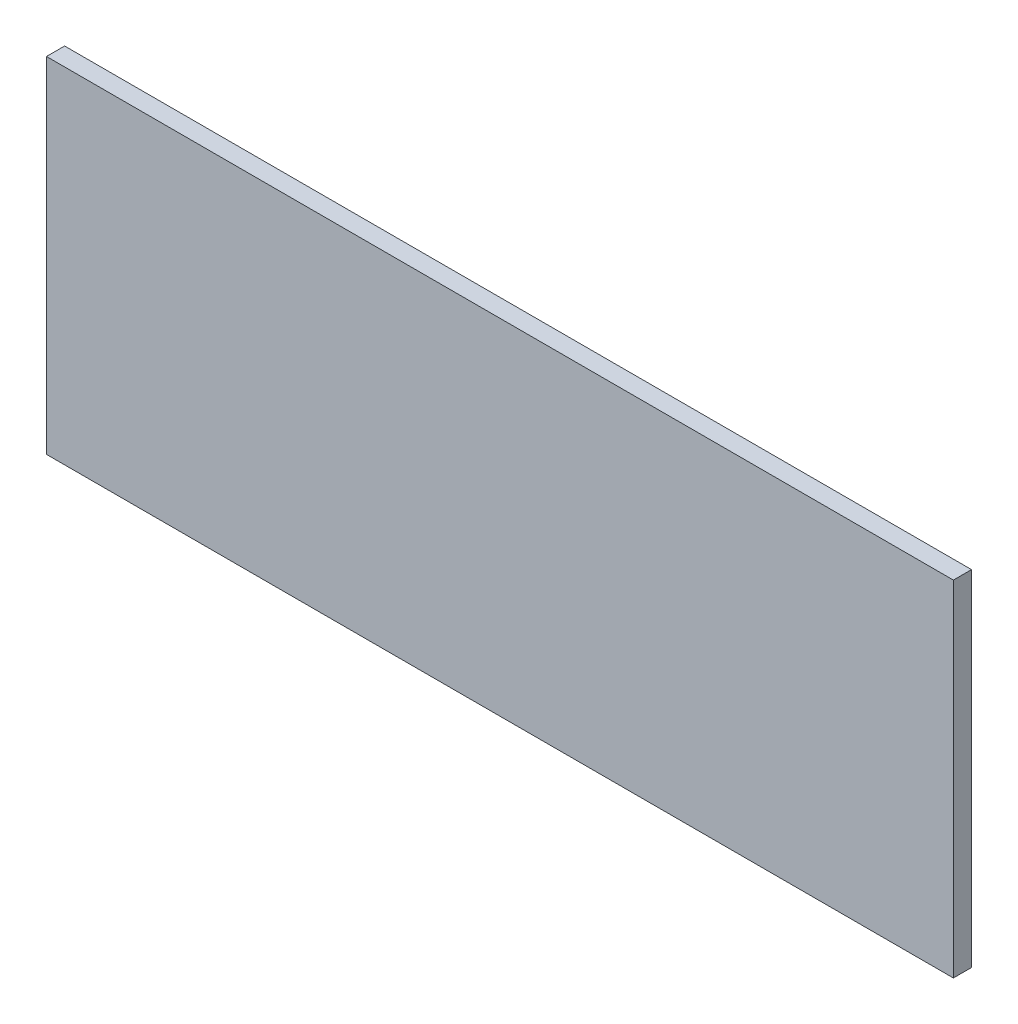
ISO-10303-21;
HEADER;
FILE_DESCRIPTION(('STEP AP214'),'2;1');
FILE_NAME('part.step','',(''),(''),'','','');
FILE_SCHEMA(('AUTOMOTIVE_DESIGN { 1 0 10303 214 1 1 1 1 }'));
ENDSEC;
DATA;
#1=APPLICATION_CONTEXT('core data for automotive mechanical design processes');
#2=APPLICATION_PROTOCOL_DEFINITION('international standard','automotive_design',2000,#1);
#3=PRODUCT_CONTEXT('',#1,'mechanical');
#4=PRODUCT('Part','Part','',(#3));
#5=PRODUCT_RELATED_PRODUCT_CATEGORY('part','',(#4));
#6=PRODUCT_DEFINITION_FORMATION('','',#4);
#7=PRODUCT_DEFINITION_CONTEXT('part definition',#1,'design');
#8=PRODUCT_DEFINITION('design','',#6,#7);
#9=PRODUCT_DEFINITION_SHAPE('','',#8);
#10=(LENGTH_UNIT() NAMED_UNIT(*) SI_UNIT(.MILLI.,.METRE.));
#11=(NAMED_UNIT(*) PLANE_ANGLE_UNIT() SI_UNIT($,.RADIAN.));
#12=(NAMED_UNIT(*) SI_UNIT($,.STERADIAN.) SOLID_ANGLE_UNIT());
#13=UNCERTAINTY_MEASURE_WITH_UNIT(LENGTH_MEASURE(1.E-05),#10,'distance_accuracy_value','');
#14=(GEOMETRIC_REPRESENTATION_CONTEXT(3) GLOBAL_UNCERTAINTY_ASSIGNED_CONTEXT((#13)) GLOBAL_UNIT_ASSIGNED_CONTEXT((#10,
#11,#12)) REPRESENTATION_CONTEXT('',''));
#15=CARTESIAN_POINT('',(0.,0.,0.));
#16=DIRECTION('',(0.,0.,1.));
#17=DIRECTION('',(1.,0.,0.));
#18=AXIS2_PLACEMENT_3D('',#15,#16,#17);
#19=CARTESIAN_POINT('',(-68.3145598576633,26.1581081081081,2.));
#20=DIRECTION('',(1.,0.,0.));
#21=DIRECTION('',(0.,0.,-1.));
#22=AXIS2_PLACEMENT_3D('',#19,#20,#21);
#23=PLANE('',#22);
#24=DIRECTION('',(0.,-1.,0.));
#25=VECTOR('',#24,1.);
#26=CARTESIAN_POINT('',(-68.3145598576633,26.1581081081081,0.));
#27=LINE('',#26,#25);
#28=CARTESIAN_POINT('',(-68.3145598576633,26.1581081081081,0.));
#29=VERTEX_POINT('',#28);
#30=CARTESIAN_POINT('',(-68.3145598576633,-11.8418918918919,0.));
#31=VERTEX_POINT('',#30);
#32=EDGE_CURVE('E94',#29,#31,#27,.T.);
#33=ORIENTED_EDGE('',*,*,#32,.T.);
#34=DIRECTION('',(0.,0.,-1.));
#35=VECTOR('',#34,1.);
#36=CARTESIAN_POINT('',(-68.3145598576633,-11.8418918918919,2.));
#37=LINE('',#36,#35);
#38=CARTESIAN_POINT('',(-68.3145598576633,-11.8418918918919,2.));
#39=VERTEX_POINT('',#38);
#40=EDGE_CURVE('E11',#39,#31,#37,.T.);
#41=ORIENTED_EDGE('',*,*,#40,.F.);
#42=DIRECTION('',(0.,-1.,0.));
#43=VECTOR('',#42,1.);
#44=CARTESIAN_POINT('',(-68.3145598576633,26.1581081081081,2.));
#45=LINE('',#44,#43);
#46=CARTESIAN_POINT('',(-68.3145598576633,26.1581081081081,2.));
#47=VERTEX_POINT('',#46);
#48=EDGE_CURVE('E82',#47,#39,#45,.T.);
#49=ORIENTED_EDGE('',*,*,#48,.F.);
#50=DIRECTION('',(0.,0.,-1.));
#51=VECTOR('',#50,1.);
#52=CARTESIAN_POINT('',(-68.3145598576633,26.1581081081081,2.));
#53=LINE('',#52,#51);
#54=EDGE_CURVE('E90',#47,#29,#53,.T.);
#55=ORIENTED_EDGE('',*,*,#54,.T.);
#56=EDGE_LOOP('',(#33,#41,#49,#55));
#57=FACE_BOUND('',#56,.T.);
#58=ADVANCED_FACE('F31',(#57),#23,.F.);
#59=CARTESIAN_POINT('',(-68.3145598576633,-11.8418918918919,2.));
#60=DIRECTION('',(0.,1.,0.));
#61=DIRECTION('',(0.,0.,1.));
#62=AXIS2_PLACEMENT_3D('',#59,#60,#61);
#63=PLANE('',#62);
#64=DIRECTION('',(1.,0.,0.));
#65=VECTOR('',#64,1.);
#66=CARTESIAN_POINT('',(-68.3145598576633,-11.8418918918919,0.));
#67=LINE('',#66,#65);
#68=CARTESIAN_POINT('',(31.6854401423367,-11.8418918918919,0.));
#69=VERTEX_POINT('',#68);
#70=EDGE_CURVE('E86',#31,#69,#67,.T.);
#71=ORIENTED_EDGE('',*,*,#70,.T.);
#72=DIRECTION('',(0.,0.,-1.));
#73=VECTOR('',#72,1.);
#74=CARTESIAN_POINT('',(31.6854401423367,-11.8418918918919,2.));
#75=LINE('',#74,#73);
#76=CARTESIAN_POINT('',(31.6854401423367,-11.8418918918919,2.));
#77=VERTEX_POINT('',#76);
#78=EDGE_CURVE('E39',#77,#69,#75,.T.);
#79=ORIENTED_EDGE('',*,*,#78,.F.);
#80=DIRECTION('',(1.,0.,0.));
#81=VECTOR('',#80,1.);
#82=CARTESIAN_POINT('',(-68.3145598576633,-11.8418918918919,2.));
#83=LINE('',#82,#81);
#84=EDGE_CURVE('E77',#39,#77,#83,.T.);
#85=ORIENTED_EDGE('',*,*,#84,.F.);
#86=ORIENTED_EDGE('',*,*,#40,.T.);
#87=EDGE_LOOP('',(#71,#79,#85,#86));
#88=FACE_BOUND('',#87,.T.);
#89=ADVANCED_FACE('F85',(#88),#63,.F.);
#90=CARTESIAN_POINT('',(31.6854401423367,26.1581081081081,2.));
#91=DIRECTION('',(-1.,0.,0.));
#92=DIRECTION('',(0.,0.,1.));
#93=AXIS2_PLACEMENT_3D('',#90,#91,#92);
#94=PLANE('',#93);
#95=DIRECTION('',(0.,1.,0.));
#96=VECTOR('',#95,1.);
#97=CARTESIAN_POINT('',(31.6854401423367,26.1581081081081,0.));
#98=LINE('',#97,#96);
#99=CARTESIAN_POINT('',(31.6854401423367,26.1581081081081,0.));
#100=VERTEX_POINT('',#99);
#101=EDGE_CURVE('E64',#69,#100,#98,.T.);
#102=ORIENTED_EDGE('',*,*,#101,.T.);
#103=DIRECTION('',(0.,0.,-1.));
#104=VECTOR('',#103,1.);
#105=CARTESIAN_POINT('',(31.6854401423367,26.1581081081081,2.));
#106=LINE('',#105,#104);
#107=CARTESIAN_POINT('',(31.6854401423367,26.1581081081081,2.));
#108=VERTEX_POINT('',#107);
#109=EDGE_CURVE('E87',#108,#100,#106,.T.);
#110=ORIENTED_EDGE('',*,*,#109,.F.);
#111=DIRECTION('',(0.,1.,0.));
#112=VECTOR('',#111,1.);
#113=CARTESIAN_POINT('',(31.6854401423367,26.1581081081081,2.));
#114=LINE('',#113,#112);
#115=EDGE_CURVE('E80',#77,#108,#114,.T.);
#116=ORIENTED_EDGE('',*,*,#115,.F.);
#117=ORIENTED_EDGE('',*,*,#78,.T.);
#118=EDGE_LOOP('',(#102,#110,#116,#117));
#119=FACE_BOUND('',#118,.T.);
#120=ADVANCED_FACE('F88',(#119),#94,.F.);
#121=CARTESIAN_POINT('',(-68.3145598576633,26.1581081081081,2.));
#122=DIRECTION('',(0.,-1.,0.));
#123=DIRECTION('',(0.,0.,-1.));
#124=AXIS2_PLACEMENT_3D('',#121,#122,#123);
#125=PLANE('',#124);
#126=DIRECTION('',(-1.,0.,0.));
#127=VECTOR('',#126,1.);
#128=CARTESIAN_POINT('',(-68.3145598576633,26.1581081081081,0.));
#129=LINE('',#128,#127);
#130=EDGE_CURVE('E70',#100,#29,#129,.T.);
#131=ORIENTED_EDGE('',*,*,#130,.T.);
#132=ORIENTED_EDGE('',*,*,#54,.F.);
#133=DIRECTION('',(-1.,0.,0.));
#134=VECTOR('',#133,1.);
#135=CARTESIAN_POINT('',(-68.3145598576633,26.1581081081081,2.));
#136=LINE('',#135,#134);
#137=EDGE_CURVE('E47',#108,#47,#136,.T.);
#138=ORIENTED_EDGE('',*,*,#137,.F.);
#139=ORIENTED_EDGE('',*,*,#109,.T.);
#140=EDGE_LOOP('',(#131,#132,#138,#139));
#141=FACE_BOUND('',#140,.T.);
#142=ADVANCED_FACE('F101',(#141),#125,.F.);
#143=CARTESIAN_POINT('',(-68.3145598576633,-11.8418918918919,2.));
#144=DIRECTION('',(0.,0.,1.));
#145=DIRECTION('',(1.,0.,0.));
#146=AXIS2_PLACEMENT_3D('',#143,#144,#145);
#147=PLANE('',#146);
#148=ORIENTED_EDGE('',*,*,#48,.T.);
#149=ORIENTED_EDGE('',*,*,#84,.T.);
#150=ORIENTED_EDGE('',*,*,#115,.T.);
#151=ORIENTED_EDGE('',*,*,#137,.T.);
#152=EDGE_LOOP('',(#148,#149,#150,#151));
#153=FACE_BOUND('',#152,.T.);
#154=ADVANCED_FACE('F78',(#153),#147,.T.);
#155=CARTESIAN_POINT('',(-68.3145598576633,-11.8418918918919,0.));
#156=DIRECTION('',(0.,0.,1.));
#157=DIRECTION('',(1.,0.,0.));
#158=AXIS2_PLACEMENT_3D('',#155,#156,#157);
#159=PLANE('',#158);
#160=ORIENTED_EDGE('',*,*,#32,.F.);
#161=ORIENTED_EDGE('',*,*,#130,.F.);
#162=ORIENTED_EDGE('',*,*,#101,.F.);
#163=ORIENTED_EDGE('',*,*,#70,.F.);
#164=EDGE_LOOP('',(#160,#161,#162,#163));
#165=FACE_BOUND('',#164,.T.);
#166=ADVANCED_FACE('F104',(#165),#159,.F.);
#167=CLOSED_SHELL('',(#58,#89,#120,#142,#154,#166));
#168=MANIFOLD_SOLID_BREP('B2',#167);
#169=ADVANCED_BREP_SHAPE_REPRESENTATION('',(#18,#168),#14);
#170=SHAPE_DEFINITION_REPRESENTATION(#9,#169);
ENDSEC;
END-ISO-10303-21;
